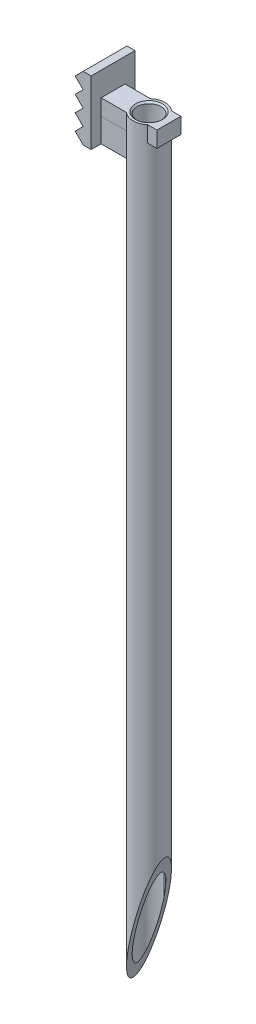
ISO-10303-21;
HEADER;
FILE_DESCRIPTION(('STEP AP214'),'2;1');
FILE_NAME('part.step','',(''),(''),'','','');
FILE_SCHEMA(('AUTOMOTIVE_DESIGN { 1 0 10303 214 1 1 1 1 }'));
ENDSEC;
DATA;
#1=APPLICATION_CONTEXT('core data for automotive mechanical design processes');
#2=APPLICATION_PROTOCOL_DEFINITION('international standard','automotive_design',2000,#1);
#3=PRODUCT_CONTEXT('',#1,'mechanical');
#4=PRODUCT('Part','Part','',(#3));
#5=PRODUCT_RELATED_PRODUCT_CATEGORY('part','',(#4));
#6=PRODUCT_DEFINITION_FORMATION('','',#4);
#7=PRODUCT_DEFINITION_CONTEXT('part definition',#1,'design');
#8=PRODUCT_DEFINITION('design','',#6,#7);
#9=PRODUCT_DEFINITION_SHAPE('','',#8);
#10=(LENGTH_UNIT() NAMED_UNIT(*) SI_UNIT(.MILLI.,.METRE.));
#11=(NAMED_UNIT(*) PLANE_ANGLE_UNIT() SI_UNIT($,.RADIAN.));
#12=(NAMED_UNIT(*) SI_UNIT($,.STERADIAN.) SOLID_ANGLE_UNIT());
#13=UNCERTAINTY_MEASURE_WITH_UNIT(LENGTH_MEASURE(1.E-05),#10,'distance_accuracy_value','');
#14=(GEOMETRIC_REPRESENTATION_CONTEXT(3) GLOBAL_UNCERTAINTY_ASSIGNED_CONTEXT((#13)) GLOBAL_UNIT_ASSIGNED_CONTEXT((#10,
#11,#12)) REPRESENTATION_CONTEXT('',''));
#15=CARTESIAN_POINT('',(0.,0.,0.));
#16=DIRECTION('',(0.,0.,1.));
#17=DIRECTION('',(1.,0.,0.));
#18=AXIS2_PLACEMENT_3D('',#15,#16,#17);
#19=CARTESIAN_POINT('',(2.255,0.,0.375));
#20=DIRECTION('',(0.,-1.,0.));
#21=DIRECTION('',(0.,0.,-1.));
#22=AXIS2_PLACEMENT_3D('',#19,#20,#21);
#23=PLANE('',#22);
#24=DIRECTION('',(-1.,0.,0.));
#25=VECTOR('',#24,1.);
#26=CARTESIAN_POINT('',(1.59356217223385,0.,1.125));
#27=LINE('',#26,#25);
#28=CARTESIAN_POINT('',(1.59356217223385,0.,1.125));
#29=VERTEX_POINT('',#28);
#30=CARTESIAN_POINT('',(0.,0.,1.125));
#31=VERTEX_POINT('',#30);
#32=EDGE_CURVE('E96',#29,#31,#27,.T.);
#33=ORIENTED_EDGE('',*,*,#32,.F.);
#34=CARTESIAN_POINT('',(2.255,0.,0.375));
#35=DIRECTION('',(0.,1.,0.));
#36=DIRECTION('',(0.,0.,-1.));
#37=AXIS2_PLACEMENT_3D('',#34,#35,#36);
#38=CIRCLE('',#37,1.);
#39=CARTESIAN_POINT('',(1.59356217223385,0.,-0.375));
#40=VERTEX_POINT('',#39);
#41=EDGE_CURVE('E107',#40,#29,#38,.T.);
#42=ORIENTED_EDGE('',*,*,#41,.F.);
#43=DIRECTION('',(1.,0.,0.));
#44=VECTOR('',#43,1.);
#45=CARTESIAN_POINT('',(0.,0.,-0.375));
#46=LINE('',#45,#44);
#47=CARTESIAN_POINT('',(0.,0.,-0.375));
#48=VERTEX_POINT('',#47);
#49=EDGE_CURVE('E98',#48,#40,#46,.T.);
#50=ORIENTED_EDGE('',*,*,#49,.F.);
#51=DIRECTION('',(0.,0.,-1.));
#52=VECTOR('',#51,1.);
#53=CARTESIAN_POINT('',(0.,0.,1.125));
#54=LINE('',#53,#52);
#55=EDGE_CURVE('E88',#31,#48,#54,.T.);
#56=ORIENTED_EDGE('',*,*,#55,.F.);
#57=EDGE_LOOP('',(#33,#42,#50,#56));
#58=FACE_BOUND('',#57,.T.);
#59=ADVANCED_FACE('F46',(#58),#23,.F.);
#60=CARTESIAN_POINT('',(2.255,-3.68847901446979,0.375));
#61=DIRECTION('',(0.,1.,0.));
#62=DIRECTION('',(0.,0.,1.));
#63=AXIS2_PLACEMENT_3D('',#60,#61,#62);
#64=CYLINDRICAL_SURFACE('',#63,1.);
#65=DIRECTION('',(0.,1.,0.));
#66=VECTOR('',#65,1.);
#67=CARTESIAN_POINT('',(1.59356217223385,-3.68847901446979,1.125));
#68=LINE('',#67,#66);
#69=CARTESIAN_POINT('',(1.59356217223385,-1.5,1.125));
#70=VERTEX_POINT('',#69);
#71=EDGE_CURVE('E101',#70,#29,#68,.T.);
#72=ORIENTED_EDGE('',*,*,#71,.F.);
#73=CARTESIAN_POINT('',(2.255,-1.5,0.375));
#74=DIRECTION('',(0.,1.,0.));
#75=DIRECTION('',(0.,0.,1.));
#76=AXIS2_PLACEMENT_3D('',#73,#74,#75);
#77=CIRCLE('',#76,1.);
#78=CARTESIAN_POINT('',(1.59356217223385,-1.5,-0.375));
#79=VERTEX_POINT('',#78);
#80=EDGE_CURVE('E50',#70,#79,#77,.F.);
#81=ORIENTED_EDGE('',*,*,#80,.T.);
#82=DIRECTION('',(0.,1.,0.));
#83=VECTOR('',#82,1.);
#84=CARTESIAN_POINT('',(1.59356217223385,-3.68847901446979,-0.375));
#85=LINE('',#84,#83);
#86=EDGE_CURVE('E110',#79,#40,#85,.T.);
#87=ORIENTED_EDGE('',*,*,#86,.T.);
#88=ORIENTED_EDGE('',*,*,#41,.T.);
#89=EDGE_LOOP('',(#72,#81,#87,#88));
#90=FACE_BOUND('',#89,.T.);
#91=ADVANCED_FACE('F119',(#90),#64,.F.);
#92=CARTESIAN_POINT('',(0.,-3.68847901446979,-0.375));
#93=DIRECTION('',(0.,0.,1.));
#94=DIRECTION('',(1.,0.,0.));
#95=AXIS2_PLACEMENT_3D('',#92,#93,#94);
#96=PLANE('',#95);
#97=ORIENTED_EDGE('',*,*,#86,.F.);
#98=DIRECTION('',(-1.,0.,0.));
#99=VECTOR('',#98,1.);
#100=CARTESIAN_POINT('',(0.,-1.5,-0.375));
#101=LINE('',#100,#99);
#102=CARTESIAN_POINT('',(0.,-1.5,-0.375));
#103=VERTEX_POINT('',#102);
#104=EDGE_CURVE('E116',#79,#103,#101,.T.);
#105=ORIENTED_EDGE('',*,*,#104,.T.);
#106=DIRECTION('',(0.,1.,0.));
#107=VECTOR('',#106,1.);
#108=CARTESIAN_POINT('',(0.,-3.68847901446979,-0.375));
#109=LINE('',#108,#107);
#110=EDGE_CURVE('E92',#103,#48,#109,.T.);
#111=ORIENTED_EDGE('',*,*,#110,.T.);
#112=ORIENTED_EDGE('',*,*,#49,.T.);
#113=EDGE_LOOP('',(#97,#105,#111,#112));
#114=FACE_BOUND('',#113,.T.);
#115=ADVANCED_FACE('F115',(#114),#96,.F.);
#116=CARTESIAN_POINT('',(0.,-3.68847901446979,1.125));
#117=DIRECTION('',(1.,0.,0.));
#118=DIRECTION('',(0.,0.,-1.));
#119=AXIS2_PLACEMENT_3D('',#116,#117,#118);
#120=PLANE('',#119);
#121=ORIENTED_EDGE('',*,*,#110,.F.);
#122=DIRECTION('',(0.,0.,1.));
#123=VECTOR('',#122,1.);
#124=CARTESIAN_POINT('',(0.,-1.5,1.125));
#125=LINE('',#124,#123);
#126=CARTESIAN_POINT('',(0.,-1.5,1.125));
#127=VERTEX_POINT('',#126);
#128=EDGE_CURVE('E55',#103,#127,#125,.T.);
#129=ORIENTED_EDGE('',*,*,#128,.T.);
#130=DIRECTION('',(0.,1.,0.));
#131=VECTOR('',#130,1.);
#132=CARTESIAN_POINT('',(0.,-3.68847901446979,1.125));
#133=LINE('',#132,#131);
#134=EDGE_CURVE('E85',#127,#31,#133,.T.);
#135=ORIENTED_EDGE('',*,*,#134,.T.);
#136=ORIENTED_EDGE('',*,*,#55,.T.);
#137=EDGE_LOOP('',(#121,#129,#135,#136));
#138=FACE_BOUND('',#137,.T.);
#139=ADVANCED_FACE('F87',(#138),#120,.F.);
#140=CARTESIAN_POINT('',(1.59356217223385,-3.68847901446979,1.125));
#141=DIRECTION('',(0.,0.,-1.));
#142=DIRECTION('',(-1.,0.,0.));
#143=AXIS2_PLACEMENT_3D('',#140,#141,#142);
#144=PLANE('',#143);
#145=ORIENTED_EDGE('',*,*,#134,.F.);
#146=DIRECTION('',(1.,0.,0.));
#147=VECTOR('',#146,1.);
#148=CARTESIAN_POINT('',(1.59356217223385,-1.5,1.125));
#149=LINE('',#148,#147);
#150=EDGE_CURVE('E12',#127,#70,#149,.T.);
#151=ORIENTED_EDGE('',*,*,#150,.T.);
#152=ORIENTED_EDGE('',*,*,#71,.T.);
#153=ORIENTED_EDGE('',*,*,#32,.T.);
#154=EDGE_LOOP('',(#145,#151,#152,#153));
#155=FACE_BOUND('',#154,.T.);
#156=ADVANCED_FACE('F48',(#155),#144,.F.);
#157=CARTESIAN_POINT('',(-1.,-1.5,-1.));
#158=DIRECTION('',(0.,1.,0.));
#159=DIRECTION('',(0.,0.,1.));
#160=AXIS2_PLACEMENT_3D('',#157,#158,#159);
#161=PLANE('',#160);
#162=ORIENTED_EDGE('',*,*,#128,.F.);
#163=ORIENTED_EDGE('',*,*,#104,.F.);
#164=ORIENTED_EDGE('',*,*,#80,.F.);
#165=ORIENTED_EDGE('',*,*,#150,.F.);
#166=EDGE_LOOP('',(#162,#163,#164,#165));
#167=FACE_BOUND('',#166,.T.);
#168=ADVANCED_FACE('F133',(#167),#161,.F.);
#169=CLOSED_SHELL('',(#59,#91,#115,#139,#156,#168));
#170=MANIFOLD_SOLID_BREP('B2',#169);
#171=CARTESIAN_POINT('',(2.255,3.82842712474619,0.375));
#172=DIRECTION('',(0.,-1.,0.));
#173=DIRECTION('',(0.,0.,-1.));
#174=AXIS2_PLACEMENT_3D('',#171,#172,#173);
#175=CYLINDRICAL_SURFACE('',#174,1.);
#176=CARTESIAN_POINT('',(2.255,-42.75,0.375));
#177=DIRECTION('',(0.966234939601246,-0.257662650560333,0.));
#178=DIRECTION('',(-0.257662650560333,-0.966234939601246,0.));
#179=AXIS2_PLACEMENT_3D('',#176,#177,#178);
#180=ELLIPSE('',#179,3.88104367406501,1.);
#181=CARTESIAN_POINT('',(1.255,-46.5,0.375));
#182=VERTEX_POINT('',#181);
#183=EDGE_CURVE('E369',#182,#182,#180,.F.);
#184=ORIENTED_EDGE('',*,*,#183,.T.);
#185=EDGE_LOOP('',(#184));
#186=FACE_BOUND('',#185,.T.);
#187=CARTESIAN_POINT('',(2.255,0.,0.375));
#188=DIRECTION('',(0.,1.,0.));
#189=DIRECTION('',(0.,0.,1.));
#190=AXIS2_PLACEMENT_3D('',#187,#188,#189);
#191=CIRCLE('',#190,1.);
#192=CARTESIAN_POINT('',(1.59356217223385,0.,-0.375));
#193=VERTEX_POINT('',#192);
#194=CARTESIAN_POINT('',(1.59356217223385,0.,1.125));
#195=VERTEX_POINT('',#194);
#196=EDGE_CURVE('E300',#193,#195,#191,.T.);
#197=ORIENTED_EDGE('',*,*,#196,.F.);
#198=DIRECTION('',(0.,-1.,0.));
#199=VECTOR('',#198,1.);
#200=CARTESIAN_POINT('',(1.59356217223385,3.82842712474619,-0.375));
#201=LINE('',#200,#199);
#202=CARTESIAN_POINT('',(1.59356217223385,1.,-0.375));
#203=VERTEX_POINT('',#202);
#204=EDGE_CURVE('E304',#203,#193,#201,.T.);
#205=ORIENTED_EDGE('',*,*,#204,.F.);
#206=CARTESIAN_POINT('',(2.255,1.,0.375));
#207=DIRECTION('',(0.,-1.,0.));
#208=DIRECTION('',(0.,0.,-1.));
#209=AXIS2_PLACEMENT_3D('',#206,#207,#208);
#210=CIRCLE('',#209,1.);
#211=CARTESIAN_POINT('',(2.91643782776615,1.,-0.375));
#212=VERTEX_POINT('',#211);
#213=EDGE_CURVE('E456',#212,#203,#210,.F.);
#214=ORIENTED_EDGE('',*,*,#213,.F.);
#215=DIRECTION('',(0.,-1.,0.));
#216=VECTOR('',#215,1.);
#217=CARTESIAN_POINT('',(2.91643782776615,3.82842712474619,-0.375));
#218=LINE('',#217,#216);
#219=CARTESIAN_POINT('',(2.91643782776615,0.,-0.375));
#220=VERTEX_POINT('',#219);
#221=EDGE_CURVE('E341',#220,#212,#218,.F.);
#222=ORIENTED_EDGE('',*,*,#221,.F.);
#223=CARTESIAN_POINT('',(2.91643782776615,0.,1.125));
#224=VERTEX_POINT('',#223);
#225=EDGE_CURVE('E312',#224,#220,#191,.T.);
#226=ORIENTED_EDGE('',*,*,#225,.F.);
#227=DIRECTION('',(0.,-1.,0.));
#228=VECTOR('',#227,1.);
#229=CARTESIAN_POINT('',(2.91643782776615,3.82842712474619,1.125));
#230=LINE('',#229,#228);
#231=CARTESIAN_POINT('',(2.91643782776615,1.,1.125));
#232=VERTEX_POINT('',#231);
#233=EDGE_CURVE('E334',#232,#224,#230,.T.);
#234=ORIENTED_EDGE('',*,*,#233,.F.);
#235=CARTESIAN_POINT('',(1.59356217223385,1.,1.125));
#236=VERTEX_POINT('',#235);
#237=EDGE_CURVE('E313',#236,#232,#210,.F.);
#238=ORIENTED_EDGE('',*,*,#237,.F.);
#239=DIRECTION('',(0.,-1.,0.));
#240=VECTOR('',#239,1.);
#241=CARTESIAN_POINT('',(1.59356217223385,3.82842712474619,1.125));
#242=LINE('',#241,#240);
#243=EDGE_CURVE('E308',#195,#236,#242,.F.);
#244=ORIENTED_EDGE('',*,*,#243,.F.);
#245=EDGE_LOOP('',(#197,#205,#214,#222,#226,#234,#238,#244));
#246=FACE_BOUND('',#245,.T.);
#247=ADVANCED_FACE('F169',(#186,#246),#175,.T.);
#248=CARTESIAN_POINT('',(0.,0.,0.));
#249=DIRECTION('',(-1.,0.,0.));
#250=DIRECTION('',(0.,0.,1.));
#251=AXIS2_PLACEMENT_3D('',#248,#249,#250);
#252=PLANE('',#251);
#253=DIRECTION('',(0.,-1.,0.));
#254=VECTOR('',#253,1.);
#255=CARTESIAN_POINT('',(0.,2.5,-1.));
#256=LINE('',#255,#254);
#257=CARTESIAN_POINT('',(0.,2.5,-1.));
#258=VERTEX_POINT('',#257);
#259=CARTESIAN_POINT('',(0.,-1.5,-1.));
#260=VERTEX_POINT('',#259);
#261=EDGE_CURVE('E436',#258,#260,#256,.T.);
#262=ORIENTED_EDGE('',*,*,#261,.F.);
#263=DIRECTION('',(0.,0.,-1.));
#264=VECTOR('',#263,1.);
#265=CARTESIAN_POINT('',(0.,2.5,-1.));
#266=LINE('',#265,#264);
#267=CARTESIAN_POINT('',(0.,2.5,1.75));
#268=VERTEX_POINT('',#267);
#269=EDGE_CURVE('E445',#268,#258,#266,.T.);
#270=ORIENTED_EDGE('',*,*,#269,.F.);
#271=DIRECTION('',(0.,1.,0.));
#272=VECTOR('',#271,1.);
#273=CARTESIAN_POINT('',(0.,2.5,1.75));
#274=LINE('',#273,#272);
#275=CARTESIAN_POINT('',(0.,-1.5,1.75));
#276=VERTEX_POINT('',#275);
#277=EDGE_CURVE('E442',#276,#268,#274,.T.);
#278=ORIENTED_EDGE('',*,*,#277,.F.);
#279=DIRECTION('',(0.,0.,1.));
#280=VECTOR('',#279,1.);
#281=CARTESIAN_POINT('',(0.,-1.5,-1.));
#282=LINE('',#281,#280);
#283=EDGE_CURVE('E439',#260,#276,#282,.T.);
#284=ORIENTED_EDGE('',*,*,#283,.F.);
#285=EDGE_LOOP('',(#262,#270,#278,#284));
#286=FACE_BOUND('',#285,.T.);
#287=DIRECTION('',(0.,0.,-1.));
#288=VECTOR('',#287,1.);
#289=CARTESIAN_POINT('',(0.,1.,0.75));
#290=LINE('',#289,#288);
#291=CARTESIAN_POINT('',(0.,1.,1.125));
#292=VERTEX_POINT('',#291);
#293=CARTESIAN_POINT('',(0.,1.,-0.375));
#294=VERTEX_POINT('',#293);
#295=EDGE_CURVE('E184',#292,#294,#290,.T.);
#296=ORIENTED_EDGE('',*,*,#295,.T.);
#297=DIRECTION('',(0.,1.,0.));
#298=VECTOR('',#297,1.);
#299=CARTESIAN_POINT('',(0.,0.,-0.375));
#300=LINE('',#299,#298);
#301=CARTESIAN_POINT('',(0.,0.,-0.375));
#302=VERTEX_POINT('',#301);
#303=EDGE_CURVE('E325',#302,#294,#300,.T.);
#304=ORIENTED_EDGE('',*,*,#303,.F.);
#305=DIRECTION('',(0.,0.,-1.));
#306=VECTOR('',#305,1.);
#307=CARTESIAN_POINT('',(0.,0.,0.75));
#308=LINE('',#307,#306);
#309=CARTESIAN_POINT('',(0.,0.,1.125));
#310=VERTEX_POINT('',#309);
#311=EDGE_CURVE('E318',#310,#302,#308,.T.);
#312=ORIENTED_EDGE('',*,*,#311,.F.);
#313=DIRECTION('',(0.,-1.,0.));
#314=VECTOR('',#313,1.);
#315=CARTESIAN_POINT('',(0.,1.,1.125));
#316=LINE('',#315,#314);
#317=EDGE_CURVE('E335',#292,#310,#316,.T.);
#318=ORIENTED_EDGE('',*,*,#317,.F.);
#319=EDGE_LOOP('',(#296,#304,#312,#318));
#320=FACE_BOUND('',#319,.T.);
#321=ADVANCED_FACE('F504',(#286,#320),#252,.F.);
#322=CARTESIAN_POINT('',(0.,0.,0.75));
#323=DIRECTION('',(0.,1.,0.));
#324=DIRECTION('',(0.,0.,1.));
#325=AXIS2_PLACEMENT_3D('',#322,#323,#324);
#326=PLANE('',#325);
#327=DIRECTION('',(0.,0.,-1.));
#328=VECTOR('',#327,1.);
#329=CARTESIAN_POINT('',(3.5,0.,0.75));
#330=LINE('',#329,#328);
#331=CARTESIAN_POINT('',(3.5,0.,1.125));
#332=VERTEX_POINT('',#331);
#333=CARTESIAN_POINT('',(3.5,0.,-0.375));
#334=VERTEX_POINT('',#333);
#335=EDGE_CURVE('E461',#332,#334,#330,.T.);
#336=ORIENTED_EDGE('',*,*,#335,.F.);
#337=DIRECTION('',(1.,0.,0.));
#338=VECTOR('',#337,1.);
#339=CARTESIAN_POINT('',(3.18202481088696,0.,1.125));
#340=LINE('',#339,#338);
#341=EDGE_CURVE('E350',#224,#332,#340,.T.);
#342=ORIENTED_EDGE('',*,*,#341,.F.);
#343=ORIENTED_EDGE('',*,*,#225,.T.);
#344=DIRECTION('',(-1.,0.,0.));
#345=VECTOR('',#344,1.);
#346=CARTESIAN_POINT('',(3.5,0.,-0.375));
#347=LINE('',#346,#345);
#348=EDGE_CURVE('E353',#334,#220,#347,.T.);
#349=ORIENTED_EDGE('',*,*,#348,.F.);
#350=EDGE_LOOP('',(#336,#342,#343,#349));
#351=FACE_BOUND('',#350,.T.);
#352=ADVANCED_FACE('F510',(#351),#326,.F.);
#353=ORIENTED_EDGE('',*,*,#311,.T.);
#354=DIRECTION('',(-1.,0.,0.));
#355=VECTOR('',#354,1.);
#356=CARTESIAN_POINT('',(1.32797518911304,0.,-0.375));
#357=LINE('',#356,#355);
#358=EDGE_CURVE('E316',#193,#302,#357,.T.);
#359=ORIENTED_EDGE('',*,*,#358,.F.);
#360=ORIENTED_EDGE('',*,*,#196,.T.);
#361=DIRECTION('',(1.,0.,0.));
#362=VECTOR('',#361,1.);
#363=CARTESIAN_POINT('',(0.,0.,1.125));
#364=LINE('',#363,#362);
#365=EDGE_CURVE('E332',#310,#195,#364,.T.);
#366=ORIENTED_EDGE('',*,*,#365,.F.);
#367=EDGE_LOOP('',(#353,#359,#360,#366));
#368=FACE_BOUND('',#367,.T.);
#369=ADVANCED_FACE('F317',(#368),#326,.F.);
#370=CARTESIAN_POINT('',(3.5,0.,0.75));
#371=DIRECTION('',(-1.,0.,0.));
#372=DIRECTION('',(0.,0.,1.));
#373=AXIS2_PLACEMENT_3D('',#370,#371,#372);
#374=PLANE('',#373);
#375=ORIENTED_EDGE('',*,*,#335,.T.);
#376=DIRECTION('',(0.,-1.,0.));
#377=VECTOR('',#376,1.);
#378=CARTESIAN_POINT('',(3.5,1.,-0.375));
#379=LINE('',#378,#377);
#380=CARTESIAN_POINT('',(3.5,1.,-0.375));
#381=VERTEX_POINT('',#380);
#382=EDGE_CURVE('E359',#381,#334,#379,.T.);
#383=ORIENTED_EDGE('',*,*,#382,.F.);
#384=DIRECTION('',(0.,0.,-1.));
#385=VECTOR('',#384,1.);
#386=CARTESIAN_POINT('',(3.5,1.,0.75));
#387=LINE('',#386,#385);
#388=CARTESIAN_POINT('',(3.5,1.,1.125));
#389=VERTEX_POINT('',#388);
#390=EDGE_CURVE('E459',#389,#381,#387,.T.);
#391=ORIENTED_EDGE('',*,*,#390,.F.);
#392=DIRECTION('',(0.,1.,0.));
#393=VECTOR('',#392,1.);
#394=CARTESIAN_POINT('',(3.5,0.,1.125));
#395=LINE('',#394,#393);
#396=EDGE_CURVE('E344',#332,#389,#395,.T.);
#397=ORIENTED_EDGE('',*,*,#396,.F.);
#398=EDGE_LOOP('',(#375,#383,#391,#397));
#399=FACE_BOUND('',#398,.T.);
#400=ADVANCED_FACE('F521',(#399),#374,.F.);
#401=CARTESIAN_POINT('',(0.,1.,0.75));
#402=DIRECTION('',(0.,-1.,0.));
#403=DIRECTION('',(0.,0.,-1.));
#404=AXIS2_PLACEMENT_3D('',#401,#402,#403);
#405=PLANE('',#404);
#406=CARTESIAN_POINT('',(2.255,1.,0.375));
#407=DIRECTION('',(0.,-1.,0.));
#408=DIRECTION('',(0.,0.,-1.));
#409=AXIS2_PLACEMENT_3D('',#406,#407,#408);
#410=CIRCLE('',#409,0.850000000000044);
#411=CARTESIAN_POINT('',(2.255,1.,-0.475000000000044));
#412=VERTEX_POINT('',#411);
#413=EDGE_CURVE('E44',#412,#412,#410,.T.);
#414=ORIENTED_EDGE('',*,*,#413,.T.);
#415=EDGE_LOOP('',(#414));
#416=FACE_BOUND('',#415,.T.);
#417=ORIENTED_EDGE('',*,*,#213,.T.);
#418=DIRECTION('',(1.,0.,0.));
#419=VECTOR('',#418,1.);
#420=CARTESIAN_POINT('',(0.,1.,-0.375));
#421=LINE('',#420,#419);
#422=EDGE_CURVE('E322',#294,#203,#421,.T.);
#423=ORIENTED_EDGE('',*,*,#422,.F.);
#424=ORIENTED_EDGE('',*,*,#295,.F.);
#425=DIRECTION('',(-1.,0.,0.));
#426=VECTOR('',#425,1.);
#427=CARTESIAN_POINT('',(1.32797518911304,1.,1.125));
#428=LINE('',#427,#426);
#429=EDGE_CURVE('E331',#236,#292,#428,.T.);
#430=ORIENTED_EDGE('',*,*,#429,.F.);
#431=ORIENTED_EDGE('',*,*,#237,.T.);
#432=DIRECTION('',(-1.,0.,0.));
#433=VECTOR('',#432,1.);
#434=CARTESIAN_POINT('',(3.5,1.,1.125));
#435=LINE('',#434,#433);
#436=EDGE_CURVE('E347',#389,#232,#435,.T.);
#437=ORIENTED_EDGE('',*,*,#436,.F.);
#438=ORIENTED_EDGE('',*,*,#390,.T.);
#439=DIRECTION('',(1.,0.,0.));
#440=VECTOR('',#439,1.);
#441=CARTESIAN_POINT('',(3.18202481088696,1.,-0.375));
#442=LINE('',#441,#440);
#443=EDGE_CURVE('E356',#212,#381,#442,.T.);
#444=ORIENTED_EDGE('',*,*,#443,.F.);
#445=EDGE_LOOP('',(#417,#423,#424,#430,#431,#437,#438,#444));
#446=FACE_BOUND('',#445,.T.);
#447=ADVANCED_FACE('F517',(#416,#446),#405,.F.);
#448=CARTESIAN_POINT('',(-1.,2.5,-1.));
#449=DIRECTION('',(0.,0.,1.));
#450=DIRECTION('',(0.,-1.,0.));
#451=AXIS2_PLACEMENT_3D('',#448,#449,#450);
#452=PLANE('',#451);
#453=DIRECTION('',(-0.707106781186565,0.70710678118653,0.));
#454=VECTOR('',#453,1.);
#455=CARTESIAN_POINT('',(-1.25000000000001,2.24999999999998,-1.));
#456=LINE('',#455,#454);
#457=CARTESIAN_POINT('',(-0.5,1.5,-1.));
#458=VERTEX_POINT('',#457);
#459=CARTESIAN_POINT('',(-0.999999999999999,1.99999999999998,-1.));
#460=VERTEX_POINT('',#459);
#461=EDGE_CURVE('E430',#458,#460,#456,.T.);
#462=ORIENTED_EDGE('',*,*,#461,.T.);
#463=DIRECTION('',(0.70710678118653,0.707106781186565,0.));
#464=VECTOR('',#463,1.);
#465=CARTESIAN_POINT('',(-0.749999999999988,2.25,-1.));
#466=LINE('',#465,#464);
#467=CARTESIAN_POINT('',(-0.5,2.5,-1.));
#468=VERTEX_POINT('',#467);
#469=EDGE_CURVE('E433',#460,#468,#466,.T.);
#470=ORIENTED_EDGE('',*,*,#469,.T.);
#471=DIRECTION('',(1.,0.,0.));
#472=VECTOR('',#471,1.);
#473=CARTESIAN_POINT('',(-1.,2.5,-1.));
#474=LINE('',#473,#472);
#475=EDGE_CURVE('E448',#468,#258,#474,.T.);
#476=ORIENTED_EDGE('',*,*,#475,.T.);
#477=ORIENTED_EDGE('',*,*,#261,.T.);
#478=DIRECTION('',(1.,0.,0.));
#479=VECTOR('',#478,1.);
#480=CARTESIAN_POINT('',(-1.,-1.5,-1.));
#481=LINE('',#480,#479);
#482=CARTESIAN_POINT('',(-0.5,-1.5,-0.999999999999999));
#483=VERTEX_POINT('',#482);
#484=EDGE_CURVE('E454',#483,#260,#481,.T.);
#485=ORIENTED_EDGE('',*,*,#484,.F.);
#486=DIRECTION('',(-0.707106781186565,0.70710678118653,0.));
#487=VECTOR('',#486,1.);
#488=CARTESIAN_POINT('',(-2.75000000000001,0.749999999999904,-1.));
#489=LINE('',#488,#487);
#490=CARTESIAN_POINT('',(-1.,-1.00000000000002,-1.));
#491=VERTEX_POINT('',#490);
#492=EDGE_CURVE('E397',#483,#491,#489,.T.);
#493=ORIENTED_EDGE('',*,*,#492,.T.);
#494=DIRECTION('',(0.707106781186531,0.707106781186564,0.));
#495=VECTOR('',#494,1.);
#496=CARTESIAN_POINT('',(0.750000000000012,0.750000000000068,-1.));
#497=LINE('',#496,#495);
#498=CARTESIAN_POINT('',(-0.499999999999999,-0.5,-0.999999999999999));
#499=VERTEX_POINT('',#498);
#500=EDGE_CURVE('E415',#491,#499,#497,.T.);
#501=ORIENTED_EDGE('',*,*,#500,.T.);
#502=DIRECTION('',(-0.707106781186565,0.70710678118653,0.));
#503=VECTOR('',#502,1.);
#504=CARTESIAN_POINT('',(-2.25000000000001,1.24999999999993,-1.));
#505=LINE('',#504,#503);
#506=CARTESIAN_POINT('',(-1.,0.,-1.));
#507=VERTEX_POINT('',#506);
#508=EDGE_CURVE('E418',#499,#507,#505,.T.);
#509=ORIENTED_EDGE('',*,*,#508,.T.);
#510=DIRECTION('',(0.707106781186531,0.707106781186564,0.));
#511=VECTOR('',#510,1.);
#512=CARTESIAN_POINT('',(0.250000000000012,1.25000000000005,-1.));
#513=LINE('',#512,#511);
#514=CARTESIAN_POINT('',(-0.499999999999998,0.500000000000002,-0.999999999999999));
#515=VERTEX_POINT('',#514);
#516=EDGE_CURVE('E421',#507,#515,#513,.T.);
#517=ORIENTED_EDGE('',*,*,#516,.T.);
#518=DIRECTION('',(-0.707106781186566,0.70710678118653,0.));
#519=VECTOR('',#518,1.);
#520=CARTESIAN_POINT('',(-1.75000000000001,1.74999999999995,-1.));
#521=LINE('',#520,#519);
#522=CARTESIAN_POINT('',(-1.,0.999999999999978,-1.));
#523=VERTEX_POINT('',#522);
#524=EDGE_CURVE('E424',#515,#523,#521,.T.);
#525=ORIENTED_EDGE('',*,*,#524,.T.);
#526=DIRECTION('',(0.707106781186531,0.707106781186564,0.));
#527=VECTOR('',#526,1.);
#528=CARTESIAN_POINT('',(-0.249999999999989,1.75000000000002,-1.));
#529=LINE('',#528,#527);
#530=EDGE_CURVE('E427',#523,#458,#529,.T.);
#531=ORIENTED_EDGE('',*,*,#530,.T.);
#532=EDGE_LOOP('',(#462,#470,#476,#477,#485,#493,#501,#509,#517,#525,#531));
#533=FACE_BOUND('',#532,.T.);
#534=ADVANCED_FACE('F520',(#533),#452,.F.);
#535=CARTESIAN_POINT('',(-1.,-1.5,-1.));
#536=DIRECTION('',(0.,1.,0.));
#537=DIRECTION('',(0.,0.,1.));
#538=AXIS2_PLACEMENT_3D('',#535,#536,#537);
#539=PLANE('',#538);
#540=DIRECTION('',(1.,0.,0.));
#541=VECTOR('',#540,1.);
#542=CARTESIAN_POINT('',(-1.,-1.5,1.75));
#543=LINE('',#542,#541);
#544=CARTESIAN_POINT('',(-0.5,-1.5,1.75));
#545=VERTEX_POINT('',#544);
#546=EDGE_CURVE('E452',#545,#276,#543,.T.);
#547=ORIENTED_EDGE('',*,*,#546,.F.);
#548=DIRECTION('',(0.,0.,1.));
#549=VECTOR('',#548,1.);
#550=CARTESIAN_POINT('',(-0.5,-1.5,-8.25));
#551=LINE('',#550,#549);
#552=EDGE_CURVE('E394',#483,#545,#551,.T.);
#553=ORIENTED_EDGE('',*,*,#552,.F.);
#554=ORIENTED_EDGE('',*,*,#484,.T.);
#555=ORIENTED_EDGE('',*,*,#283,.T.);
#556=EDGE_LOOP('',(#547,#553,#554,#555));
#557=FACE_BOUND('',#556,.T.);
#558=ADVANCED_FACE('F620',(#557),#539,.F.);
#559=CARTESIAN_POINT('',(-1.,2.5,1.75));
#560=DIRECTION('',(0.,0.,-1.));
#561=DIRECTION('',(0.,1.,0.));
#562=AXIS2_PLACEMENT_3D('',#559,#560,#561);
#563=PLANE('',#562);
#564=DIRECTION('',(1.,0.,0.));
#565=VECTOR('',#564,1.);
#566=CARTESIAN_POINT('',(-1.,2.5,1.75));
#567=LINE('',#566,#565);
#568=CARTESIAN_POINT('',(-0.499999999999998,2.5,1.75));
#569=VERTEX_POINT('',#568);
#570=EDGE_CURVE('E450',#569,#268,#567,.T.);
#571=ORIENTED_EDGE('',*,*,#570,.F.);
#572=DIRECTION('',(0.70710678118653,0.707106781186565,0.));
#573=VECTOR('',#572,1.);
#574=CARTESIAN_POINT('',(-0.999999999999999,1.99999999999998,1.75));
#575=LINE('',#574,#573);
#576=CARTESIAN_POINT('',(-0.999999999999999,1.99999999999998,1.75));
#577=VERTEX_POINT('',#576);
#578=EDGE_CURVE('E192',#577,#569,#575,.T.);
#579=ORIENTED_EDGE('',*,*,#578,.F.);
#580=DIRECTION('',(-0.707106781186565,0.70710678118653,0.));
#581=VECTOR('',#580,1.);
#582=CARTESIAN_POINT('',(-0.5,1.5,1.75));
#583=LINE('',#582,#581);
#584=CARTESIAN_POINT('',(-0.5,1.5,1.75));
#585=VERTEX_POINT('',#584);
#586=EDGE_CURVE('E390',#585,#577,#583,.T.);
#587=ORIENTED_EDGE('',*,*,#586,.F.);
#588=DIRECTION('',(0.707106781186531,0.707106781186564,0.));
#589=VECTOR('',#588,1.);
#590=CARTESIAN_POINT('',(-1.,0.999999999999978,1.75));
#591=LINE('',#590,#589);
#592=CARTESIAN_POINT('',(-1.,0.999999999999978,1.75));
#593=VERTEX_POINT('',#592);
#594=EDGE_CURVE('E387',#593,#585,#591,.T.);
#595=ORIENTED_EDGE('',*,*,#594,.F.);
#596=DIRECTION('',(-0.707106781186565,0.707106781186529,0.));
#597=VECTOR('',#596,1.);
#598=CARTESIAN_POINT('',(-0.499999999999998,0.500000000000002,1.75));
#599=LINE('',#598,#597);
#600=CARTESIAN_POINT('',(-0.499999999999998,0.500000000000002,1.75));
#601=VERTEX_POINT('',#600);
#602=EDGE_CURVE('E384',#601,#593,#599,.T.);
#603=ORIENTED_EDGE('',*,*,#602,.F.);
#604=DIRECTION('',(0.707106781186531,0.707106781186564,0.));
#605=VECTOR('',#604,1.);
#606=CARTESIAN_POINT('',(-1.,0.,1.75));
#607=LINE('',#606,#605);
#608=CARTESIAN_POINT('',(-1.,0.,1.75));
#609=VERTEX_POINT('',#608);
#610=EDGE_CURVE('E381',#609,#601,#607,.T.);
#611=ORIENTED_EDGE('',*,*,#610,.F.);
#612=DIRECTION('',(-0.707106781186565,0.70710678118653,0.));
#613=VECTOR('',#612,1.);
#614=CARTESIAN_POINT('',(-0.499999999999999,-0.5,1.75));
#615=LINE('',#614,#613);
#616=CARTESIAN_POINT('',(-0.499999999999999,-0.5,1.75));
#617=VERTEX_POINT('',#616);
#618=EDGE_CURVE('E378',#617,#609,#615,.T.);
#619=ORIENTED_EDGE('',*,*,#618,.F.);
#620=DIRECTION('',(0.707106781186531,0.707106781186564,0.));
#621=VECTOR('',#620,1.);
#622=CARTESIAN_POINT('',(-1.,-1.00000000000002,1.75));
#623=LINE('',#622,#621);
#624=CARTESIAN_POINT('',(-1.,-1.00000000000002,1.75));
#625=VERTEX_POINT('',#624);
#626=EDGE_CURVE('E375',#625,#617,#623,.T.);
#627=ORIENTED_EDGE('',*,*,#626,.F.);
#628=DIRECTION('',(-0.707106781186565,0.707106781186531,0.));
#629=VECTOR('',#628,1.);
#630=CARTESIAN_POINT('',(-0.5,-1.5,1.75));
#631=LINE('',#630,#629);
#632=EDGE_CURVE('E372',#545,#625,#631,.T.);
#633=ORIENTED_EDGE('',*,*,#632,.F.);
#634=ORIENTED_EDGE('',*,*,#546,.T.);
#635=ORIENTED_EDGE('',*,*,#277,.T.);
#636=EDGE_LOOP('',(#571,#579,#587,#595,#603,#611,#619,#627,#633,#634,#635));
#637=FACE_BOUND('',#636,.T.);
#638=ADVANCED_FACE('F616',(#637),#563,.F.);
#639=CARTESIAN_POINT('',(-1.,2.5,-1.));
#640=DIRECTION('',(0.,-1.,0.));
#641=DIRECTION('',(0.,0.,-1.));
#642=AXIS2_PLACEMENT_3D('',#639,#640,#641);
#643=PLANE('',#642);
#644=ORIENTED_EDGE('',*,*,#475,.F.);
#645=DIRECTION('',(0.,0.,1.));
#646=VECTOR('',#645,1.);
#647=CARTESIAN_POINT('',(-0.5,2.5,-8.25));
#648=LINE('',#647,#646);
#649=EDGE_CURVE('E395',#468,#569,#648,.T.);
#650=ORIENTED_EDGE('',*,*,#649,.T.);
#651=ORIENTED_EDGE('',*,*,#570,.T.);
#652=ORIENTED_EDGE('',*,*,#269,.T.);
#653=EDGE_LOOP('',(#644,#650,#651,#652));
#654=FACE_BOUND('',#653,.T.);
#655=ADVANCED_FACE('F587',(#654),#643,.F.);
#656=CARTESIAN_POINT('',(-0.999999999999999,1.99999999999998,-8.25));
#657=DIRECTION('',(0.707106781186565,-0.70710678118653,0.));
#658=DIRECTION('',(0.70710678118653,0.707106781186565,0.));
#659=AXIS2_PLACEMENT_3D('',#656,#657,#658);
#660=PLANE('',#659);
#661=DIRECTION('',(0.,0.,1.));
#662=VECTOR('',#661,1.);
#663=CARTESIAN_POINT('',(-0.999999999999999,1.99999999999998,-8.25));
#664=LINE('',#663,#662);
#665=EDGE_CURVE('E398',#460,#577,#664,.T.);
#666=ORIENTED_EDGE('',*,*,#665,.T.);
#667=ORIENTED_EDGE('',*,*,#578,.T.);
#668=ORIENTED_EDGE('',*,*,#649,.F.);
#669=ORIENTED_EDGE('',*,*,#469,.F.);
#670=EDGE_LOOP('',(#666,#667,#668,#669));
#671=FACE_BOUND('',#670,.T.);
#672=ADVANCED_FACE('F583',(#671),#660,.F.);
#673=CARTESIAN_POINT('',(-0.5,1.5,-8.25));
#674=DIRECTION('',(0.70710678118653,0.707106781186565,0.));
#675=DIRECTION('',(-0.707106781186565,0.70710678118653,0.));
#676=AXIS2_PLACEMENT_3D('',#673,#674,#675);
#677=PLANE('',#676);
#678=DIRECTION('',(0.,0.,1.));
#679=VECTOR('',#678,1.);
#680=CARTESIAN_POINT('',(-0.5,1.5,-8.25));
#681=LINE('',#680,#679);
#682=EDGE_CURVE('E400',#458,#585,#681,.T.);
#683=ORIENTED_EDGE('',*,*,#682,.T.);
#684=ORIENTED_EDGE('',*,*,#586,.T.);
#685=ORIENTED_EDGE('',*,*,#665,.F.);
#686=ORIENTED_EDGE('',*,*,#461,.F.);
#687=EDGE_LOOP('',(#683,#684,#685,#686));
#688=FACE_BOUND('',#687,.T.);
#689=ADVANCED_FACE('F586',(#688),#677,.F.);
#690=CARTESIAN_POINT('',(-1.,0.999999999999978,-8.25));
#691=DIRECTION('',(0.707106781186564,-0.707106781186531,0.));
#692=DIRECTION('',(0.707106781186531,0.707106781186564,0.));
#693=AXIS2_PLACEMENT_3D('',#690,#691,#692);
#694=PLANE('',#693);
#695=DIRECTION('',(0.,0.,1.));
#696=VECTOR('',#695,1.);
#697=CARTESIAN_POINT('',(-1.,0.999999999999978,-8.25));
#698=LINE('',#697,#696);
#699=EDGE_CURVE('E402',#523,#593,#698,.T.);
#700=ORIENTED_EDGE('',*,*,#699,.T.);
#701=ORIENTED_EDGE('',*,*,#594,.T.);
#702=ORIENTED_EDGE('',*,*,#682,.F.);
#703=ORIENTED_EDGE('',*,*,#530,.F.);
#704=EDGE_LOOP('',(#700,#701,#702,#703));
#705=FACE_BOUND('',#704,.T.);
#706=ADVANCED_FACE('F590',(#705),#694,.F.);
#707=CARTESIAN_POINT('',(-0.499999999999998,0.500000000000002,-8.25));
#708=DIRECTION('',(0.707106781186529,0.707106781186565,0.));
#709=DIRECTION('',(-0.707106781186566,0.70710678118653,0.));
#710=AXIS2_PLACEMENT_3D('',#707,#708,#709);
#711=PLANE('',#710);
#712=DIRECTION('',(0.,0.,1.));
#713=VECTOR('',#712,1.);
#714=CARTESIAN_POINT('',(-0.499999999999998,0.500000000000002,-8.25));
#715=LINE('',#714,#713);
#716=EDGE_CURVE('E404',#515,#601,#715,.T.);
#717=ORIENTED_EDGE('',*,*,#716,.T.);
#718=ORIENTED_EDGE('',*,*,#602,.T.);
#719=ORIENTED_EDGE('',*,*,#699,.F.);
#720=ORIENTED_EDGE('',*,*,#524,.F.);
#721=EDGE_LOOP('',(#717,#718,#719,#720));
#722=FACE_BOUND('',#721,.T.);
#723=ADVANCED_FACE('F594',(#722),#711,.F.);
#724=CARTESIAN_POINT('',(-1.,0.,-8.25));
#725=DIRECTION('',(0.707106781186564,-0.707106781186531,0.));
#726=DIRECTION('',(0.707106781186531,0.707106781186564,0.));
#727=AXIS2_PLACEMENT_3D('',#724,#725,#726);
#728=PLANE('',#727);
#729=DIRECTION('',(0.,0.,1.));
#730=VECTOR('',#729,1.);
#731=CARTESIAN_POINT('',(-1.,0.,-8.25));
#732=LINE('',#731,#730);
#733=EDGE_CURVE('E406',#507,#609,#732,.T.);
#734=ORIENTED_EDGE('',*,*,#733,.T.);
#735=ORIENTED_EDGE('',*,*,#610,.T.);
#736=ORIENTED_EDGE('',*,*,#716,.F.);
#737=ORIENTED_EDGE('',*,*,#516,.F.);
#738=EDGE_LOOP('',(#734,#735,#736,#737));
#739=FACE_BOUND('',#738,.T.);
#740=ADVANCED_FACE('F598',(#739),#728,.F.);
#741=CARTESIAN_POINT('',(-0.499999999999999,-0.5,-8.25));
#742=DIRECTION('',(0.70710678118653,0.707106781186565,0.));
#743=DIRECTION('',(-0.707106781186565,0.70710678118653,0.));
#744=AXIS2_PLACEMENT_3D('',#741,#742,#743);
#745=PLANE('',#744);
#746=DIRECTION('',(0.,0.,1.));
#747=VECTOR('',#746,1.);
#748=CARTESIAN_POINT('',(-0.499999999999999,-0.5,-8.25));
#749=LINE('',#748,#747);
#750=EDGE_CURVE('E408',#499,#617,#749,.T.);
#751=ORIENTED_EDGE('',*,*,#750,.T.);
#752=ORIENTED_EDGE('',*,*,#618,.T.);
#753=ORIENTED_EDGE('',*,*,#733,.F.);
#754=ORIENTED_EDGE('',*,*,#508,.F.);
#755=EDGE_LOOP('',(#751,#752,#753,#754));
#756=FACE_BOUND('',#755,.T.);
#757=ADVANCED_FACE('F602',(#756),#745,.F.);
#758=CARTESIAN_POINT('',(-1.,-1.00000000000002,-8.25));
#759=DIRECTION('',(0.707106781186564,-0.707106781186531,0.));
#760=DIRECTION('',(0.707106781186531,0.707106781186564,0.));
#761=AXIS2_PLACEMENT_3D('',#758,#759,#760);
#762=PLANE('',#761);
#763=DIRECTION('',(0.,0.,1.));
#764=VECTOR('',#763,1.);
#765=CARTESIAN_POINT('',(-1.,-1.00000000000002,-8.25));
#766=LINE('',#765,#764);
#767=EDGE_CURVE('E410',#491,#625,#766,.T.);
#768=ORIENTED_EDGE('',*,*,#767,.T.);
#769=ORIENTED_EDGE('',*,*,#626,.T.);
#770=ORIENTED_EDGE('',*,*,#750,.F.);
#771=ORIENTED_EDGE('',*,*,#500,.F.);
#772=EDGE_LOOP('',(#768,#769,#770,#771));
#773=FACE_BOUND('',#772,.T.);
#774=ADVANCED_FACE('F606',(#773),#762,.F.);
#775=CARTESIAN_POINT('',(-0.5,-1.5,-8.25));
#776=DIRECTION('',(0.70710678118653,0.707106781186565,0.));
#777=DIRECTION('',(-0.707106781186565,0.70710678118653,0.));
#778=AXIS2_PLACEMENT_3D('',#775,#776,#777);
#779=PLANE('',#778);
#780=ORIENTED_EDGE('',*,*,#552,.T.);
#781=ORIENTED_EDGE('',*,*,#632,.T.);
#782=ORIENTED_EDGE('',*,*,#767,.F.);
#783=ORIENTED_EDGE('',*,*,#492,.F.);
#784=EDGE_LOOP('',(#780,#781,#782,#783));
#785=FACE_BOUND('',#784,.T.);
#786=ADVANCED_FACE('F581',(#785),#779,.F.);
#787=CARTESIAN_POINT('',(1.255,-46.5,-1.));
#788=DIRECTION('',(0.966234939601246,-0.257662650560333,0.));
#789=DIRECTION('',(0.257662650560333,0.966234939601246,0.));
#790=AXIS2_PLACEMENT_3D('',#787,#788,#789);
#791=PLANE('',#790);
#792=ORIENTED_EDGE('',*,*,#183,.F.);
#793=EDGE_LOOP('',(#792));
#794=FACE_BOUND('',#793,.T.);
#795=CARTESIAN_POINT('',(2.255,-42.75,0.375));
#796=DIRECTION('',(0.966234939601246,-0.257662650560333,0.));
#797=DIRECTION('',(-0.257662650560333,-0.966234939601246,0.));
#798=AXIS2_PLACEMENT_3D('',#795,#796,#797);
#799=ELLIPSE('',#798,2.91078275554875,0.75);
#800=CARTESIAN_POINT('',(1.505,-45.5625,0.375));
#801=VERTEX_POINT('',#800);
#802=EDGE_CURVE('E368',#801,#801,#799,.F.);
#803=ORIENTED_EDGE('',*,*,#802,.T.);
#804=EDGE_LOOP('',(#803));
#805=FACE_BOUND('',#804,.T.);
#806=ADVANCED_FACE('F577',(#794,#805),#791,.T.);
#807=CARTESIAN_POINT('',(2.255,-28.5,0.375));
#808=DIRECTION('',(0.,-1.,0.));
#809=DIRECTION('',(0.,0.,-1.));
#810=AXIS2_PLACEMENT_3D('',#807,#808,#809);
#811=PLANE('',#810);
#812=CARTESIAN_POINT('',(2.255,-28.5,0.375));
#813=DIRECTION('',(0.,-1.,0.));
#814=DIRECTION('',(0.,0.,-1.));
#815=AXIS2_PLACEMENT_3D('',#812,#813,#814);
#816=CIRCLE('',#815,0.425);
#817=CARTESIAN_POINT('',(2.255,-28.5,-0.0499999999999999));
#818=VERTEX_POINT('',#817);
#819=EDGE_CURVE('E487',#818,#818,#816,.F.);
#820=ORIENTED_EDGE('',*,*,#819,.T.);
#821=EDGE_LOOP('',(#820));
#822=FACE_BOUND('',#821,.T.);
#823=CARTESIAN_POINT('',(2.255,-28.5,0.375));
#824=DIRECTION('',(0.,-1.,0.));
#825=DIRECTION('',(0.,0.,-1.));
#826=AXIS2_PLACEMENT_3D('',#823,#824,#825);
#827=CIRCLE('',#826,0.5);
#828=CARTESIAN_POINT('',(2.255,-28.5,-0.125));
#829=VERTEX_POINT('',#828);
#830=EDGE_CURVE('E478',#829,#829,#827,.T.);
#831=ORIENTED_EDGE('',*,*,#830,.T.);
#832=EDGE_LOOP('',(#831));
#833=FACE_BOUND('',#832,.T.);
#834=ADVANCED_FACE('F580',(#822,#833),#811,.T.);
#835=CARTESIAN_POINT('',(2.255,-28.5,0.375));
#836=DIRECTION('',(0.,-1.,0.));
#837=DIRECTION('',(0.,0.,-1.));
#838=AXIS2_PLACEMENT_3D('',#835,#836,#837);
#839=CYLINDRICAL_SURFACE('',#838,0.75);
#840=CARTESIAN_POINT('',(2.255,-28.75,0.375));
#841=DIRECTION('',(0.,-1.,0.));
#842=DIRECTION('',(0.,0.,-1.));
#843=AXIS2_PLACEMENT_3D('',#840,#841,#842);
#844=CIRCLE('',#843,0.75);
#845=CARTESIAN_POINT('',(2.255,-28.75,-0.375));
#846=VERTEX_POINT('',#845);
#847=EDGE_CURVE('E481',#846,#846,#844,.F.);
#848=ORIENTED_EDGE('',*,*,#847,.T.);
#849=EDGE_LOOP('',(#848));
#850=FACE_BOUND('',#849,.T.);
#851=ORIENTED_EDGE('',*,*,#802,.F.);
#852=EDGE_LOOP('',(#851));
#853=FACE_BOUND('',#852,.T.);
#854=ADVANCED_FACE('F515',(#850,#853),#839,.F.);
#855=CARTESIAN_POINT('',(2.255,-28.,0.375));
#856=DIRECTION('',(0.,1.,0.));
#857=DIRECTION('',(0.,0.,1.));
#858=AXIS2_PLACEMENT_3D('',#855,#856,#857);
#859=CYLINDRICAL_SURFACE('',#858,0.75);
#860=CARTESIAN_POINT('',(2.255,0.899999999999956,0.375));
#861=DIRECTION('',(0.,-1.,0.));
#862=DIRECTION('',(0.,0.,-1.));
#863=AXIS2_PLACEMENT_3D('',#860,#861,#862);
#864=CIRCLE('',#863,0.75);
#865=CARTESIAN_POINT('',(2.255,0.899999999999956,-0.375));
#866=VERTEX_POINT('',#865);
#867=EDGE_CURVE('E177',#866,#866,#864,.F.);
#868=ORIENTED_EDGE('',*,*,#867,.T.);
#869=EDGE_LOOP('',(#868));
#870=FACE_BOUND('',#869,.T.);
#871=CARTESIAN_POINT('',(2.255,-28.,0.375));
#872=DIRECTION('',(0.,1.,0.));
#873=DIRECTION('',(0.,0.,1.));
#874=AXIS2_PLACEMENT_3D('',#871,#872,#873);
#875=CIRCLE('',#874,0.75);
#876=CARTESIAN_POINT('',(2.255,-28.,1.125));
#877=VERTEX_POINT('',#876);
#878=EDGE_CURVE('E365',#877,#877,#875,.T.);
#879=ORIENTED_EDGE('',*,*,#878,.F.);
#880=EDGE_LOOP('',(#879));
#881=FACE_BOUND('',#880,.T.);
#882=ADVANCED_FACE('F492',(#870,#881),#859,.F.);
#883=CARTESIAN_POINT('',(2.255,-28.,0.375));
#884=DIRECTION('',(0.,1.,0.));
#885=DIRECTION('',(0.,0.,1.));
#886=AXIS2_PLACEMENT_3D('',#883,#884,#885);
#887=PLANE('',#886);
#888=CARTESIAN_POINT('',(2.255,-28.,0.375));
#889=DIRECTION('',(0.,1.,0.));
#890=DIRECTION('',(0.,0.,1.));
#891=AXIS2_PLACEMENT_3D('',#888,#889,#890);
#892=CIRCLE('',#891,0.4);
#893=CARTESIAN_POINT('',(2.255,-28.,0.775));
#894=VERTEX_POINT('',#893);
#895=EDGE_CURVE('E362',#894,#894,#892,.T.);
#896=ORIENTED_EDGE('',*,*,#895,.F.);
#897=EDGE_LOOP('',(#896));
#898=FACE_BOUND('',#897,.T.);
#899=ORIENTED_EDGE('',*,*,#878,.T.);
#900=EDGE_LOOP('',(#899));
#901=FACE_BOUND('',#900,.T.);
#902=ADVANCED_FACE('F570',(#898,#901),#887,.T.);
#903=CARTESIAN_POINT('',(2.255,-27.,0.375));
#904=DIRECTION('',(0.,-1.,0.));
#905=DIRECTION('',(0.,0.,-1.));
#906=AXIS2_PLACEMENT_3D('',#903,#904,#905);
#907=CYLINDRICAL_SURFACE('',#906,0.4);
#908=CARTESIAN_POINT('',(2.255,-27.025,0.375));
#909=DIRECTION('',(0.,1.,0.));
#910=DIRECTION('',(0.,0.,1.));
#911=AXIS2_PLACEMENT_3D('',#908,#909,#910);
#912=CIRCLE('',#911,0.4);
#913=CARTESIAN_POINT('',(2.255,-27.025,0.775));
#914=VERTEX_POINT('',#913);
#915=EDGE_CURVE('E475',#914,#914,#912,.F.);
#916=ORIENTED_EDGE('',*,*,#915,.T.);
#917=EDGE_LOOP('',(#916));
#918=FACE_BOUND('',#917,.T.);
#919=ORIENTED_EDGE('',*,*,#895,.T.);
#920=EDGE_LOOP('',(#919));
#921=FACE_BOUND('',#920,.T.);
#922=ADVANCED_FACE('F563',(#918,#921),#907,.T.);
#923=CARTESIAN_POINT('',(2.255,-27.,0.375));
#924=DIRECTION('',(0.,1.,0.));
#925=DIRECTION('',(0.,0.,1.));
#926=AXIS2_PLACEMENT_3D('',#923,#924,#925);
#927=PLANE('',#926);
#928=CARTESIAN_POINT('',(2.255,-27.,0.375));
#929=DIRECTION('',(0.,1.,0.));
#930=DIRECTION('',(0.,0.,1.));
#931=AXIS2_PLACEMENT_3D('',#928,#929,#930);
#932=CIRCLE('',#931,0.375);
#933=CARTESIAN_POINT('',(2.255,-27.,0.75));
#934=VERTEX_POINT('',#933);
#935=EDGE_CURVE('E472',#934,#934,#932,.T.);
#936=ORIENTED_EDGE('',*,*,#935,.T.);
#937=EDGE_LOOP('',(#936));
#938=FACE_BOUND('',#937,.T.);
#939=CARTESIAN_POINT('',(2.255,-27.,0.375));
#940=DIRECTION('',(0.,1.,0.));
#941=DIRECTION('',(0.,0.,1.));
#942=AXIS2_PLACEMENT_3D('',#939,#940,#941);
#943=CIRCLE('',#942,0.35);
#944=CARTESIAN_POINT('',(2.255,-27.,0.725));
#945=VERTEX_POINT('',#944);
#946=EDGE_CURVE('E469',#945,#945,#943,.F.);
#947=ORIENTED_EDGE('',*,*,#946,.T.);
#948=EDGE_LOOP('',(#947));
#949=FACE_BOUND('',#948,.T.);
#950=ADVANCED_FACE('F556',(#938,#949),#927,.T.);
#951=CARTESIAN_POINT('',(2.255,-62.,0.375));
#952=DIRECTION('',(0.,1.,0.));
#953=DIRECTION('',(0.,0.,1.));
#954=AXIS2_PLACEMENT_3D('',#951,#952,#953);
#955=CYLINDRICAL_SURFACE('',#954,0.325);
#956=CARTESIAN_POINT('',(2.255,-28.4,0.375));
#957=DIRECTION('',(0.,-1.,0.));
#958=DIRECTION('',(0.,0.,-1.));
#959=AXIS2_PLACEMENT_3D('',#956,#957,#958);
#960=CIRCLE('',#959,0.325);
#961=CARTESIAN_POINT('',(2.255,-28.4,0.0500000000000001));
#962=VERTEX_POINT('',#961);
#963=EDGE_CURVE('E484',#962,#962,#960,.T.);
#964=ORIENTED_EDGE('',*,*,#963,.T.);
#965=EDGE_LOOP('',(#964));
#966=FACE_BOUND('',#965,.T.);
#967=CARTESIAN_POINT('',(2.255,-27.025,0.375));
#968=DIRECTION('',(0.,1.,0.));
#969=DIRECTION('',(0.,0.,1.));
#970=AXIS2_PLACEMENT_3D('',#967,#968,#969);
#971=CIRCLE('',#970,0.325);
#972=CARTESIAN_POINT('',(2.255,-27.025,0.7));
#973=VERTEX_POINT('',#972);
#974=EDGE_CURVE('E464',#973,#973,#971,.T.);
#975=ORIENTED_EDGE('',*,*,#974,.T.);
#976=EDGE_LOOP('',(#975));
#977=FACE_BOUND('',#976,.T.);
#978=ADVANCED_FACE('F532',(#966,#977),#955,.F.);
#979=CARTESIAN_POINT('',(2.255,-27.025,0.375));
#980=DIRECTION('',(0.,1.,0.));
#981=DIRECTION('',(0.,0.,1.));
#982=AXIS2_PLACEMENT_3D('',#979,#980,#981);
#983=TOROIDAL_SURFACE('',#982,0.35,0.025);
#984=ORIENTED_EDGE('',*,*,#946,.F.);
#985=EDGE_LOOP('',(#984));
#986=FACE_BOUND('',#985,.T.);
#987=ORIENTED_EDGE('',*,*,#974,.F.);
#988=EDGE_LOOP('',(#987));
#989=FACE_BOUND('',#988,.T.);
#990=ADVANCED_FACE('F528',(#986,#989),#983,.T.);
#991=CARTESIAN_POINT('',(2.255,-27.025,0.375));
#992=DIRECTION('',(0.,1.,0.));
#993=DIRECTION('',(0.,0.,1.));
#994=AXIS2_PLACEMENT_3D('',#991,#992,#993);
#995=TOROIDAL_SURFACE('',#994,0.375,0.025);
#996=ORIENTED_EDGE('',*,*,#915,.F.);
#997=EDGE_LOOP('',(#996));
#998=FACE_BOUND('',#997,.T.);
#999=ORIENTED_EDGE('',*,*,#935,.F.);
#1000=EDGE_LOOP('',(#999));
#1001=FACE_BOUND('',#1000,.T.);
#1002=ADVANCED_FACE('F531',(#998,#1001),#995,.T.);
#1003=CARTESIAN_POINT('',(2.255,-28.75,0.375));
#1004=DIRECTION('',(0.,-1.,0.));
#1005=DIRECTION('',(0.,0.,-1.));
#1006=AXIS2_PLACEMENT_3D('',#1003,#1004,#1005);
#1007=TOROIDAL_SURFACE('',#1006,0.5,0.25);
#1008=ORIENTED_EDGE('',*,*,#847,.F.);
#1009=EDGE_LOOP('',(#1008));
#1010=FACE_BOUND('',#1009,.T.);
#1011=ORIENTED_EDGE('',*,*,#830,.F.);
#1012=EDGE_LOOP('',(#1011));
#1013=FACE_BOUND('',#1012,.T.);
#1014=ADVANCED_FACE('F536',(#1010,#1013),#1007,.F.);
#1015=CARTESIAN_POINT('',(2.255,-28.4,0.375));
#1016=DIRECTION('',(0.,-1.,0.));
#1017=DIRECTION('',(0.,0.,-1.));
#1018=AXIS2_PLACEMENT_3D('',#1015,#1016,#1017);
#1019=TOROIDAL_SURFACE('',#1018,0.425,0.1);
#1020=ORIENTED_EDGE('',*,*,#819,.F.);
#1021=EDGE_LOOP('',(#1020));
#1022=FACE_BOUND('',#1021,.T.);
#1023=ORIENTED_EDGE('',*,*,#963,.F.);
#1024=EDGE_LOOP('',(#1023));
#1025=FACE_BOUND('',#1024,.T.);
#1026=ADVANCED_FACE('F539',(#1022,#1025),#1019,.T.);
#1027=CARTESIAN_POINT('',(0.,0.,-0.375));
#1028=DIRECTION('',(0.,0.,-1.));
#1029=DIRECTION('',(-1.,0.,0.));
#1030=AXIS2_PLACEMENT_3D('',#1027,#1028,#1029);
#1031=PLANE('',#1030);
#1032=ORIENTED_EDGE('',*,*,#348,.T.);
#1033=ORIENTED_EDGE('',*,*,#221,.T.);
#1034=ORIENTED_EDGE('',*,*,#443,.T.);
#1035=ORIENTED_EDGE('',*,*,#382,.T.);
#1036=EDGE_LOOP('',(#1032,#1033,#1034,#1035));
#1037=FACE_BOUND('',#1036,.T.);
#1038=ADVANCED_FACE('F542',(#1037),#1031,.T.);
#1039=CARTESIAN_POINT('',(0.,0.,1.125));
#1040=DIRECTION('',(0.,0.,1.));
#1041=DIRECTION('',(1.,0.,0.));
#1042=AXIS2_PLACEMENT_3D('',#1039,#1040,#1041);
#1043=PLANE('',#1042);
#1044=ORIENTED_EDGE('',*,*,#396,.T.);
#1045=ORIENTED_EDGE('',*,*,#436,.T.);
#1046=ORIENTED_EDGE('',*,*,#233,.T.);
#1047=ORIENTED_EDGE('',*,*,#341,.T.);
#1048=EDGE_LOOP('',(#1044,#1045,#1046,#1047));
#1049=FACE_BOUND('',#1048,.T.);
#1050=ADVANCED_FACE('F547',(#1049),#1043,.T.);
#1051=CARTESIAN_POINT('',(0.,0.,1.125));
#1052=DIRECTION('',(0.,0.,1.));
#1053=DIRECTION('',(1.,0.,0.));
#1054=AXIS2_PLACEMENT_3D('',#1051,#1052,#1053);
#1055=PLANE('',#1054);
#1056=ORIENTED_EDGE('',*,*,#429,.T.);
#1057=ORIENTED_EDGE('',*,*,#317,.T.);
#1058=ORIENTED_EDGE('',*,*,#365,.T.);
#1059=ORIENTED_EDGE('',*,*,#243,.T.);
#1060=EDGE_LOOP('',(#1056,#1057,#1058,#1059));
#1061=FACE_BOUND('',#1060,.T.);
#1062=ADVANCED_FACE('F500',(#1061),#1055,.T.);
#1063=CARTESIAN_POINT('',(0.,0.,-0.375));
#1064=DIRECTION('',(0.,0.,-1.));
#1065=DIRECTION('',(-1.,0.,0.));
#1066=AXIS2_PLACEMENT_3D('',#1063,#1064,#1065);
#1067=PLANE('',#1066);
#1068=ORIENTED_EDGE('',*,*,#303,.T.);
#1069=ORIENTED_EDGE('',*,*,#422,.T.);
#1070=ORIENTED_EDGE('',*,*,#204,.T.);
#1071=ORIENTED_EDGE('',*,*,#358,.T.);
#1072=EDGE_LOOP('',(#1068,#1069,#1070,#1071));
#1073=FACE_BOUND('',#1072,.T.);
#1074=ADVANCED_FACE('F324',(#1073),#1067,.T.);
#1075=CARTESIAN_POINT('',(2.255,0.899999999999956,0.375));
#1076=DIRECTION('',(0.,1.,0.));
#1077=DIRECTION('',(0.,0.,1.));
#1078=AXIS2_PLACEMENT_3D('',#1075,#1076,#1077);
#1079=CONICAL_SURFACE('',#1078,0.75,0.785398163397452);
#1080=ORIENTED_EDGE('',*,*,#413,.F.);
#1081=EDGE_LOOP('',(#1080));
#1082=FACE_BOUND('',#1081,.T.);
#1083=ORIENTED_EDGE('',*,*,#867,.F.);
#1084=EDGE_LOOP('',(#1083));
#1085=FACE_BOUND('',#1084,.T.);
#1086=ADVANCED_FACE('F171',(#1082,#1085),#1079,.F.);
#1087=CLOSED_SHELL('',(#247,#321,#352,#369,#400,#447,#534,#558,#638,#655,#672,#689,#706,#723,
#740,#757,#774,#786,#806,#834,#854,#882,#902,#922,#950,#978,#990,#1002,#1014,#1026,#1038,#1050,
#1062,#1074,#1086));
#1088=MANIFOLD_SOLID_BREP('B6',#1087);
#1089=ADVANCED_BREP_SHAPE_REPRESENTATION('',(#18,#170,#1088),#14);
#1090=SHAPE_DEFINITION_REPRESENTATION(#9,#1089);
ENDSEC;
END-ISO-10303-21;
